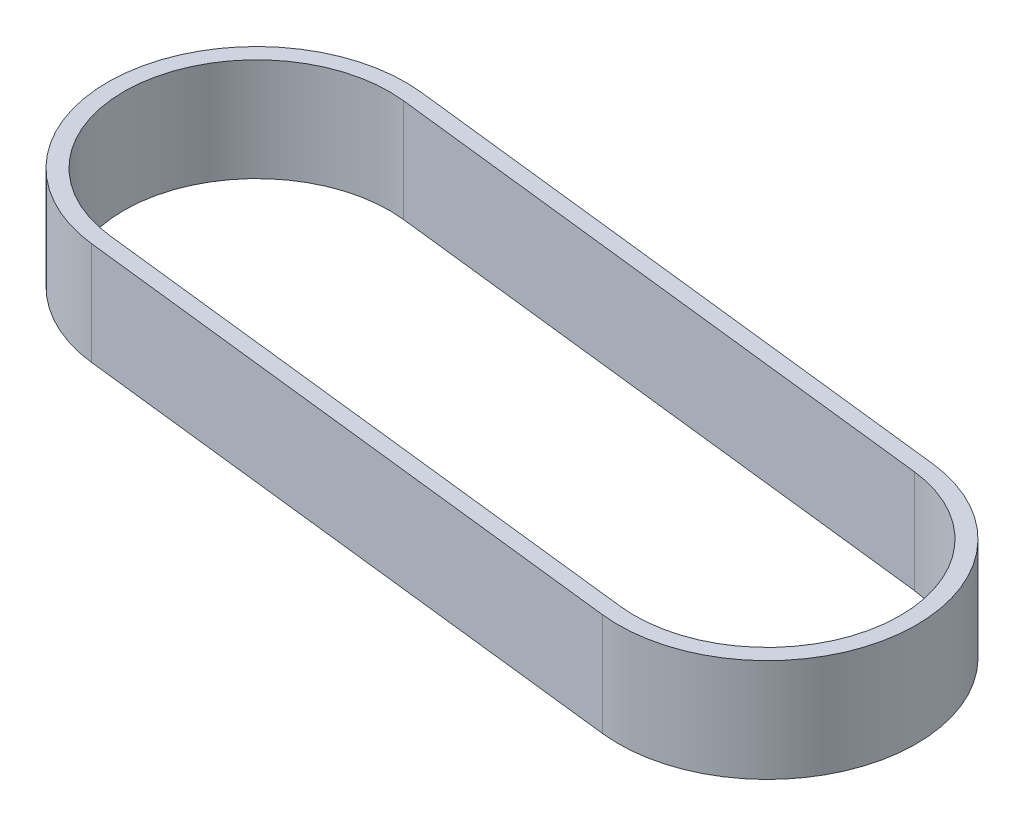
ISO-10303-21;
HEADER;
FILE_DESCRIPTION(('STEP AP214'),'2;1');
FILE_NAME('part.step','',(''),(''),'','','');
FILE_SCHEMA(('AUTOMOTIVE_DESIGN { 1 0 10303 214 1 1 1 1 }'));
ENDSEC;
DATA;
#1=APPLICATION_CONTEXT('core data for automotive mechanical design processes');
#2=APPLICATION_PROTOCOL_DEFINITION('international standard','automotive_design',2000,#1);
#3=PRODUCT_CONTEXT('',#1,'mechanical');
#4=PRODUCT('Part','Part','',(#3));
#5=PRODUCT_RELATED_PRODUCT_CATEGORY('part','',(#4));
#6=PRODUCT_DEFINITION_FORMATION('','',#4);
#7=PRODUCT_DEFINITION_CONTEXT('part definition',#1,'design');
#8=PRODUCT_DEFINITION('design','',#6,#7);
#9=PRODUCT_DEFINITION_SHAPE('','',#8);
#10=(LENGTH_UNIT() NAMED_UNIT(*) SI_UNIT(.MILLI.,.METRE.));
#11=(NAMED_UNIT(*) PLANE_ANGLE_UNIT() SI_UNIT($,.RADIAN.));
#12=(NAMED_UNIT(*) SI_UNIT($,.STERADIAN.) SOLID_ANGLE_UNIT());
#13=UNCERTAINTY_MEASURE_WITH_UNIT(LENGTH_MEASURE(1.E-05),#10,'distance_accuracy_value','');
#14=(GEOMETRIC_REPRESENTATION_CONTEXT(3) GLOBAL_UNCERTAINTY_ASSIGNED_CONTEXT((#13)) GLOBAL_UNIT_ASSIGNED_CONTEXT((#10,
#11,#12)) REPRESENTATION_CONTEXT('',''));
#15=CARTESIAN_POINT('',(0.,0.,0.));
#16=DIRECTION('',(0.,0.,1.));
#17=DIRECTION('',(1.,0.,0.));
#18=AXIS2_PLACEMENT_3D('',#15,#16,#17);
#19=CARTESIAN_POINT('',(0.,9.652,0.));
#20=DIRECTION('',(0.,1.,0.));
#21=DIRECTION('',(0.,0.,1.));
#22=AXIS2_PLACEMENT_3D('',#19,#20,#21);
#23=PLANE('',#22);
#24=CARTESIAN_POINT('',(0.,9.652,0.));
#25=DIRECTION('',(0.,1.,0.));
#26=DIRECTION('',(0.,0.,1.));
#27=AXIS2_PLACEMENT_3D('',#24,#25,#26);
#28=CIRCLE('',#27,13.97);
#29=CARTESIAN_POINT('',(1.58493821642827,9.652,-13.8798008217015));
#30=VERTEX_POINT('',#29);
#31=CARTESIAN_POINT('',(-1.58493821642827,9.652,13.8798008217015));
#32=VERTEX_POINT('',#31);
#33=EDGE_CURVE('E170',#30,#32,#28,.T.);
#34=ORIENTED_EDGE('',*,*,#33,.T.);
#35=DIRECTION('',(0.993543365905618,0.,0.113452986143756));
#36=VECTOR('',#35,1.);
#37=CARTESIAN_POINT('',(-1.58493821642827,9.652,13.8798008217015));
#38=LINE('',#37,#36);
#39=CARTESIAN_POINT('',(52.5170617835717,9.652,20.0577228601166));
#40=VERTEX_POINT('',#39);
#41=EDGE_CURVE('E174',#32,#40,#38,.T.);
#42=ORIENTED_EDGE('',*,*,#41,.T.);
#43=CARTESIAN_POINT('',(54.102,9.652,6.17792203841514));
#44=DIRECTION('',(0.,1.,0.));
#45=DIRECTION('',(0.,0.,1.));
#46=AXIS2_PLACEMENT_3D('',#43,#44,#45);
#47=CIRCLE('',#46,13.97);
#48=CARTESIAN_POINT('',(55.6869382164283,9.652,-7.70187878328634));
#49=VERTEX_POINT('',#48);
#50=EDGE_CURVE('E177',#40,#49,#47,.T.);
#51=ORIENTED_EDGE('',*,*,#50,.T.);
#52=DIRECTION('',(-0.993543365905618,0.,-0.113452986143756));
#53=VECTOR('',#52,1.);
#54=CARTESIAN_POINT('',(1.58493821642827,9.652,-13.8798008217015));
#55=LINE('',#54,#53);
#56=EDGE_CURVE('E180',#49,#30,#55,.T.);
#57=ORIENTED_EDGE('',*,*,#56,.T.);
#58=EDGE_LOOP('',(#34,#42,#51,#57));
#59=FACE_BOUND('',#58,.T.);
#60=DIRECTION('',(0.993543365905618,0.,0.113452986143756));
#61=VECTOR('',#60,1.);
#62=CARTESIAN_POINT('',(-1.41203586554519,9.652,12.3656407320613));
#63=LINE('',#62,#61);
#64=CARTESIAN_POINT('',(-1.41203586554519,9.652,12.3656407320613));
#65=VERTEX_POINT('',#64);
#66=CARTESIAN_POINT('',(52.6899641344548,9.652,18.5435627704765));
#67=VERTEX_POINT('',#66);
#68=EDGE_CURVE('E130',#65,#67,#63,.T.);
#69=ORIENTED_EDGE('',*,*,#68,.F.);
#70=CARTESIAN_POINT('',(0.,9.652,0.));
#71=DIRECTION('',(0.,1.,0.));
#72=DIRECTION('',(0.,0.,1.));
#73=AXIS2_PLACEMENT_3D('',#70,#71,#72);
#74=CIRCLE('',#73,12.446);
#75=CARTESIAN_POINT('',(1.41203586554518,9.652,-12.3656407320613));
#76=VERTEX_POINT('',#75);
#77=EDGE_CURVE('E121',#76,#65,#74,.T.);
#78=ORIENTED_EDGE('',*,*,#77,.F.);
#79=DIRECTION('',(-0.993543365905618,0.,-0.113452986143756));
#80=VECTOR('',#79,1.);
#81=CARTESIAN_POINT('',(1.41203586554518,9.652,-12.3656407320613));
#82=LINE('',#81,#80);
#83=CARTESIAN_POINT('',(55.5140358655452,9.652,-6.18771869364618));
#84=VERTEX_POINT('',#83);
#85=EDGE_CURVE('E148',#84,#76,#82,.T.);
#86=ORIENTED_EDGE('',*,*,#85,.F.);
#87=CARTESIAN_POINT('',(54.102,9.652,6.17792203841514));
#88=DIRECTION('',(0.,1.,0.));
#89=DIRECTION('',(0.,0.,1.));
#90=AXIS2_PLACEMENT_3D('',#87,#88,#89);
#91=CIRCLE('',#90,12.446);
#92=EDGE_CURVE('E143',#67,#84,#91,.T.);
#93=ORIENTED_EDGE('',*,*,#92,.F.);
#94=EDGE_LOOP('',(#69,#78,#86,#93));
#95=FACE_BOUND('',#94,.T.);
#96=ADVANCED_FACE('F39',(#59,#95),#23,.T.);
#97=CARTESIAN_POINT('',(0.,0.,0.));
#98=DIRECTION('',(0.,1.,0.));
#99=DIRECTION('',(0.,0.,1.));
#100=AXIS2_PLACEMENT_3D('',#97,#98,#99);
#101=PLANE('',#100);
#102=CARTESIAN_POINT('',(0.,0.,0.));
#103=DIRECTION('',(0.,1.,0.));
#104=DIRECTION('',(0.,0.,1.));
#105=AXIS2_PLACEMENT_3D('',#102,#103,#104);
#106=CIRCLE('',#105,13.97);
#107=CARTESIAN_POINT('',(1.58493821642827,0.,-13.8798008217015));
#108=VERTEX_POINT('',#107);
#109=CARTESIAN_POINT('',(-1.58493821642827,0.,13.8798008217015));
#110=VERTEX_POINT('',#109);
#111=EDGE_CURVE('E139',#108,#110,#106,.T.);
#112=ORIENTED_EDGE('',*,*,#111,.F.);
#113=DIRECTION('',(-0.993543365905618,0.,-0.113452986143756));
#114=VECTOR('',#113,1.);
#115=CARTESIAN_POINT('',(1.58493821642827,0.,-13.8798008217015));
#116=LINE('',#115,#114);
#117=CARTESIAN_POINT('',(55.6869382164283,0.,-7.70187878328634));
#118=VERTEX_POINT('',#117);
#119=EDGE_CURVE('E175',#118,#108,#116,.T.);
#120=ORIENTED_EDGE('',*,*,#119,.F.);
#121=CARTESIAN_POINT('',(54.102,0.,6.17792203841514));
#122=DIRECTION('',(0.,1.,0.));
#123=DIRECTION('',(0.,0.,1.));
#124=AXIS2_PLACEMENT_3D('',#121,#122,#123);
#125=CIRCLE('',#124,13.97);
#126=CARTESIAN_POINT('',(52.5170617835717,0.,20.0577228601166));
#127=VERTEX_POINT('',#126);
#128=EDGE_CURVE('E190',#127,#118,#125,.T.);
#129=ORIENTED_EDGE('',*,*,#128,.F.);
#130=DIRECTION('',(0.993543365905618,0.,0.113452986143756));
#131=VECTOR('',#130,1.);
#132=CARTESIAN_POINT('',(-1.58493821642827,0.,13.8798008217015));
#133=LINE('',#132,#131);
#134=EDGE_CURVE('E187',#110,#127,#133,.T.);
#135=ORIENTED_EDGE('',*,*,#134,.F.);
#136=EDGE_LOOP('',(#112,#120,#129,#135));
#137=FACE_BOUND('',#136,.T.);
#138=CARTESIAN_POINT('',(0.,0.,0.));
#139=DIRECTION('',(0.,1.,0.));
#140=DIRECTION('',(0.,0.,1.));
#141=AXIS2_PLACEMENT_3D('',#138,#139,#140);
#142=CIRCLE('',#141,12.446);
#143=CARTESIAN_POINT('',(1.41203586554518,0.,-12.3656407320613));
#144=VERTEX_POINT('',#143);
#145=CARTESIAN_POINT('',(-1.41203586554519,0.,12.3656407320613));
#146=VERTEX_POINT('',#145);
#147=EDGE_CURVE('E69',#144,#146,#142,.T.);
#148=ORIENTED_EDGE('',*,*,#147,.T.);
#149=DIRECTION('',(0.993543365905618,0.,0.113452986143756));
#150=VECTOR('',#149,1.);
#151=CARTESIAN_POINT('',(-1.41203586554519,0.,12.3656407320613));
#152=LINE('',#151,#150);
#153=CARTESIAN_POINT('',(52.6899641344548,0.,18.5435627704765));
#154=VERTEX_POINT('',#153);
#155=EDGE_CURVE('E137',#146,#154,#152,.T.);
#156=ORIENTED_EDGE('',*,*,#155,.T.);
#157=CARTESIAN_POINT('',(54.102,0.,6.17792203841514));
#158=DIRECTION('',(0.,1.,0.));
#159=DIRECTION('',(0.,0.,1.));
#160=AXIS2_PLACEMENT_3D('',#157,#158,#159);
#161=CIRCLE('',#160,12.446);
#162=CARTESIAN_POINT('',(55.5140358655452,0.,-6.18771869364619));
#163=VERTEX_POINT('',#162);
#164=EDGE_CURVE('E157',#154,#163,#161,.T.);
#165=ORIENTED_EDGE('',*,*,#164,.T.);
#166=DIRECTION('',(-0.993543365905618,0.,-0.113452986143756));
#167=VECTOR('',#166,1.);
#168=CARTESIAN_POINT('',(1.41203586554518,0.,-12.3656407320613));
#169=LINE('',#168,#167);
#170=EDGE_CURVE('E131',#163,#144,#169,.T.);
#171=ORIENTED_EDGE('',*,*,#170,.T.);
#172=EDGE_LOOP('',(#148,#156,#165,#171));
#173=FACE_BOUND('',#172,.T.);
#174=ADVANCED_FACE('F213',(#137,#173),#101,.F.);
#175=CARTESIAN_POINT('',(0.,9.652,0.));
#176=DIRECTION('',(0.,-1.,0.));
#177=DIRECTION('',(0.,0.,-1.));
#178=AXIS2_PLACEMENT_3D('',#175,#176,#177);
#179=CYLINDRICAL_SURFACE('',#178,13.97);
#180=ORIENTED_EDGE('',*,*,#111,.T.);
#181=DIRECTION('',(0.,-1.,0.));
#182=VECTOR('',#181,1.);
#183=CARTESIAN_POINT('',(-1.58493821642827,9.652,13.8798008217015));
#184=LINE('',#183,#182);
#185=EDGE_CURVE('E11',#32,#110,#184,.T.);
#186=ORIENTED_EDGE('',*,*,#185,.F.);
#187=ORIENTED_EDGE('',*,*,#33,.F.);
#188=DIRECTION('',(0.,-1.,0.));
#189=VECTOR('',#188,1.);
#190=CARTESIAN_POINT('',(1.58493821642827,9.652,-13.8798008217015));
#191=LINE('',#190,#189);
#192=EDGE_CURVE('E183',#30,#108,#191,.T.);
#193=ORIENTED_EDGE('',*,*,#192,.T.);
#194=EDGE_LOOP('',(#180,#186,#187,#193));
#195=FACE_BOUND('',#194,.T.);
#196=ADVANCED_FACE('F41',(#195),#179,.T.);
#197=CARTESIAN_POINT('',(-1.58493821642827,9.652,13.8798008217015));
#198=DIRECTION('',(0.113452986143756,0.,-0.993543365905618));
#199=DIRECTION('',(-0.993543365905618,0.,-0.113452986143756));
#200=AXIS2_PLACEMENT_3D('',#197,#198,#199);
#201=PLANE('',#200);
#202=ORIENTED_EDGE('',*,*,#134,.T.);
#203=DIRECTION('',(0.,-1.,0.));
#204=VECTOR('',#203,1.);
#205=CARTESIAN_POINT('',(52.5170617835717,9.652,20.0577228601166));
#206=LINE('',#205,#204);
#207=EDGE_CURVE('E48',#40,#127,#206,.T.);
#208=ORIENTED_EDGE('',*,*,#207,.F.);
#209=ORIENTED_EDGE('',*,*,#41,.F.);
#210=ORIENTED_EDGE('',*,*,#185,.T.);
#211=EDGE_LOOP('',(#202,#208,#209,#210));
#212=FACE_BOUND('',#211,.T.);
#213=ADVANCED_FACE('F223',(#212),#201,.F.);
#214=CARTESIAN_POINT('',(54.102,9.652,6.17792203841514));
#215=DIRECTION('',(0.,-1.,0.));
#216=DIRECTION('',(0.,0.,-1.));
#217=AXIS2_PLACEMENT_3D('',#214,#215,#216);
#218=CYLINDRICAL_SURFACE('',#217,13.97);
#219=ORIENTED_EDGE('',*,*,#128,.T.);
#220=DIRECTION('',(0.,-1.,0.));
#221=VECTOR('',#220,1.);
#222=CARTESIAN_POINT('',(55.6869382164283,9.652,-7.70187878328634));
#223=LINE('',#222,#221);
#224=EDGE_CURVE('E198',#49,#118,#223,.T.);
#225=ORIENTED_EDGE('',*,*,#224,.F.);
#226=ORIENTED_EDGE('',*,*,#50,.F.);
#227=ORIENTED_EDGE('',*,*,#207,.T.);
#228=EDGE_LOOP('',(#219,#225,#226,#227));
#229=FACE_BOUND('',#228,.T.);
#230=ADVANCED_FACE('F207',(#229),#218,.T.);
#231=CARTESIAN_POINT('',(1.58493821642827,9.652,-13.8798008217015));
#232=DIRECTION('',(-0.113452986143756,0.,0.993543365905618));
#233=DIRECTION('',(0.993543365905618,0.,0.113452986143756));
#234=AXIS2_PLACEMENT_3D('',#231,#232,#233);
#235=PLANE('',#234);
#236=ORIENTED_EDGE('',*,*,#119,.T.);
#237=ORIENTED_EDGE('',*,*,#192,.F.);
#238=ORIENTED_EDGE('',*,*,#56,.F.);
#239=ORIENTED_EDGE('',*,*,#224,.T.);
#240=EDGE_LOOP('',(#236,#237,#238,#239));
#241=FACE_BOUND('',#240,.T.);
#242=ADVANCED_FACE('F217',(#241),#235,.F.);
#243=CARTESIAN_POINT('',(0.,9.652,0.));
#244=DIRECTION('',(0.,-1.,0.));
#245=DIRECTION('',(0.,0.,-1.));
#246=AXIS2_PLACEMENT_3D('',#243,#244,#245);
#247=CYLINDRICAL_SURFACE('',#246,12.446);
#248=ORIENTED_EDGE('',*,*,#147,.F.);
#249=DIRECTION('',(0.,-1.,0.));
#250=VECTOR('',#249,1.);
#251=CARTESIAN_POINT('',(1.41203586554518,9.652,-12.3656407320613));
#252=LINE('',#251,#250);
#253=EDGE_CURVE('E125',#76,#144,#252,.T.);
#254=ORIENTED_EDGE('',*,*,#253,.F.);
#255=ORIENTED_EDGE('',*,*,#77,.T.);
#256=DIRECTION('',(0.,-1.,0.));
#257=VECTOR('',#256,1.);
#258=CARTESIAN_POINT('',(-1.41203586554519,9.652,12.3656407320613));
#259=LINE('',#258,#257);
#260=EDGE_CURVE('E124',#65,#146,#259,.T.);
#261=ORIENTED_EDGE('',*,*,#260,.T.);
#262=EDGE_LOOP('',(#248,#254,#255,#261));
#263=FACE_BOUND('',#262,.T.);
#264=ADVANCED_FACE('F123',(#263),#247,.F.);
#265=CARTESIAN_POINT('',(-1.41203586554519,9.652,12.3656407320613));
#266=DIRECTION('',(0.113452986143756,0.,-0.993543365905618));
#267=DIRECTION('',(-0.993543365905618,0.,-0.113452986143756));
#268=AXIS2_PLACEMENT_3D('',#265,#266,#267);
#269=PLANE('',#268);
#270=ORIENTED_EDGE('',*,*,#155,.F.);
#271=ORIENTED_EDGE('',*,*,#260,.F.);
#272=ORIENTED_EDGE('',*,*,#68,.T.);
#273=DIRECTION('',(0.,-1.,0.));
#274=VECTOR('',#273,1.);
#275=CARTESIAN_POINT('',(52.6899641344548,9.652,18.5435627704765));
#276=LINE('',#275,#274);
#277=EDGE_CURVE('E140',#67,#154,#276,.T.);
#278=ORIENTED_EDGE('',*,*,#277,.T.);
#279=EDGE_LOOP('',(#270,#271,#272,#278));
#280=FACE_BOUND('',#279,.T.);
#281=ADVANCED_FACE('F134',(#280),#269,.T.);
#282=CARTESIAN_POINT('',(54.102,9.652,6.17792203841514));
#283=DIRECTION('',(0.,-1.,0.));
#284=DIRECTION('',(0.,0.,-1.));
#285=AXIS2_PLACEMENT_3D('',#282,#283,#284);
#286=CYLINDRICAL_SURFACE('',#285,12.446);
#287=ORIENTED_EDGE('',*,*,#164,.F.);
#288=ORIENTED_EDGE('',*,*,#277,.F.);
#289=ORIENTED_EDGE('',*,*,#92,.T.);
#290=DIRECTION('',(0.,-1.,0.));
#291=VECTOR('',#290,1.);
#292=CARTESIAN_POINT('',(55.5140358655452,9.652,-6.18771869364619));
#293=LINE('',#292,#291);
#294=EDGE_CURVE('E58',#84,#163,#293,.T.);
#295=ORIENTED_EDGE('',*,*,#294,.T.);
#296=EDGE_LOOP('',(#287,#288,#289,#295));
#297=FACE_BOUND('',#296,.T.);
#298=ADVANCED_FACE('F246',(#297),#286,.F.);
#299=CARTESIAN_POINT('',(1.41203586554518,9.652,-12.3656407320613));
#300=DIRECTION('',(-0.113452986143756,0.,0.993543365905618));
#301=DIRECTION('',(0.993543365905618,0.,0.113452986143756));
#302=AXIS2_PLACEMENT_3D('',#299,#300,#301);
#303=PLANE('',#302);
#304=ORIENTED_EDGE('',*,*,#170,.F.);
#305=ORIENTED_EDGE('',*,*,#294,.F.);
#306=ORIENTED_EDGE('',*,*,#85,.T.);
#307=ORIENTED_EDGE('',*,*,#253,.T.);
#308=EDGE_LOOP('',(#304,#305,#306,#307));
#309=FACE_BOUND('',#308,.T.);
#310=ADVANCED_FACE('F250',(#309),#303,.T.);
#311=CLOSED_SHELL('',(#96,#174,#196,#213,#230,#242,#264,#281,#298,#310));
#312=MANIFOLD_SOLID_BREP('B2',#311);
#313=ADVANCED_BREP_SHAPE_REPRESENTATION('',(#18,#312),#14);
#314=SHAPE_DEFINITION_REPRESENTATION(#9,#313);
ENDSEC;
END-ISO-10303-21;
